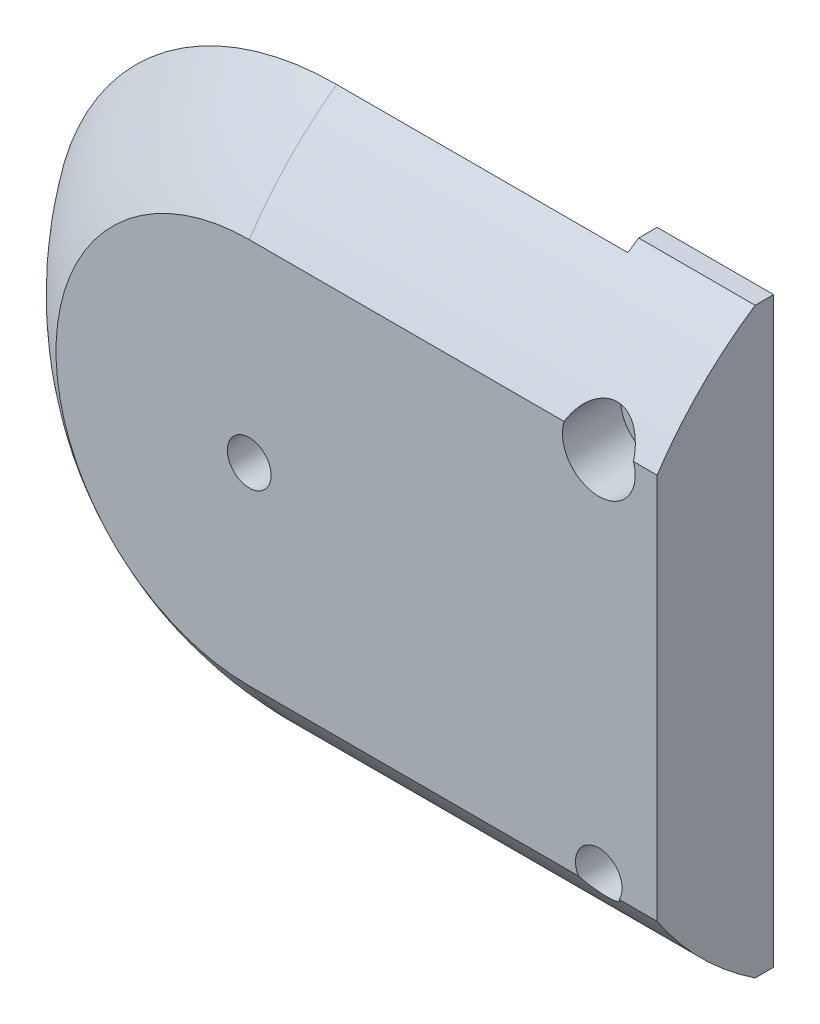
ISO-10303-21;
HEADER;
FILE_DESCRIPTION(('STEP AP214'),'2;1');
FILE_NAME('part.step','',(''),(''),'','','');
FILE_SCHEMA(('AUTOMOTIVE_DESIGN { 1 0 10303 214 1 1 1 1 }'));
ENDSEC;
DATA;
#1=APPLICATION_CONTEXT('core data for automotive mechanical design processes');
#2=APPLICATION_PROTOCOL_DEFINITION('international standard','automotive_design',2000,#1);
#3=PRODUCT_CONTEXT('',#1,'mechanical');
#4=PRODUCT('Part','Part','',(#3));
#5=PRODUCT_RELATED_PRODUCT_CATEGORY('part','',(#4));
#6=PRODUCT_DEFINITION_FORMATION('','',#4);
#7=PRODUCT_DEFINITION_CONTEXT('part definition',#1,'design');
#8=PRODUCT_DEFINITION('design','',#6,#7);
#9=PRODUCT_DEFINITION_SHAPE('','',#8);
#10=(LENGTH_UNIT() NAMED_UNIT(*) SI_UNIT(.MILLI.,.METRE.));
#11=(NAMED_UNIT(*) PLANE_ANGLE_UNIT() SI_UNIT($,.RADIAN.));
#12=(NAMED_UNIT(*) SI_UNIT($,.STERADIAN.) SOLID_ANGLE_UNIT());
#13=UNCERTAINTY_MEASURE_WITH_UNIT(LENGTH_MEASURE(1.E-05),#10,'distance_accuracy_value','');
#14=(GEOMETRIC_REPRESENTATION_CONTEXT(3) GLOBAL_UNCERTAINTY_ASSIGNED_CONTEXT((#13)) GLOBAL_UNIT_ASSIGNED_CONTEXT((#10,
#11,#12)) REPRESENTATION_CONTEXT('',''));
#15=CARTESIAN_POINT('',(0.,0.,0.));
#16=DIRECTION('',(0.,0.,1.));
#17=DIRECTION('',(1.,0.,0.));
#18=AXIS2_PLACEMENT_3D('',#15,#16,#17);
#19=CARTESIAN_POINT('',(0.,0.,0.));
#20=DIRECTION('',(0.,0.,1.));
#21=DIRECTION('',(1.,0.,0.));
#22=AXIS2_PLACEMENT_3D('',#19,#20,#21);
#23=PLANE('',#22);
#24=DIRECTION('',(-1.,0.,0.));
#25=VECTOR('',#24,1.);
#26=CARTESIAN_POINT('',(14.0000000040447,-6.6332495807108,0.));
#27=LINE('',#26,#25);
#28=CARTESIAN_POINT('',(14.0000000040447,-6.6332495807108,0.));
#29=VERTEX_POINT('',#28);
#30=CARTESIAN_POINT('',(12.7022248675215,-6.6332495807108,0.));
#31=VERTEX_POINT('',#30);
#32=EDGE_CURVE('E313',#29,#31,#27,.T.);
#33=ORIENTED_EDGE('',*,*,#32,.F.);
#34=DIRECTION('',(0.,-1.,0.));
#35=VECTOR('',#34,1.);
#36=CARTESIAN_POINT('',(14.0000000040447,0.,0.));
#37=LINE('',#36,#35);
#38=CARTESIAN_POINT('',(14.0000000040447,6.6332495807108,0.));
#39=VERTEX_POINT('',#38);
#40=EDGE_CURVE('E196',#39,#29,#37,.T.);
#41=ORIENTED_EDGE('',*,*,#40,.F.);
#42=DIRECTION('',(-1.,0.,0.));
#43=VECTOR('',#42,1.);
#44=CARTESIAN_POINT('',(14.0000000040447,6.6332495807108,0.));
#45=LINE('',#44,#43);
#46=CARTESIAN_POINT('',(13.1897982049532,6.6332495807108,0.));
#47=VERTEX_POINT('',#46);
#48=EDGE_CURVE('E292',#47,#39,#45,.F.);
#49=ORIENTED_EDGE('',*,*,#48,.F.);
#50=CARTESIAN_POINT('',(12.0000000040447,6.25,0.));
#51=DIRECTION('',(0.,0.,1.));
#52=DIRECTION('',(1.,0.,0.));
#53=AXIS2_PLACEMENT_3D('',#50,#51,#52);
#54=CIRCLE('',#53,1.25);
#55=CARTESIAN_POINT('',(10.8102018031363,6.6332495807108,0.));
#56=VERTEX_POINT('',#55);
#57=EDGE_CURVE('E165',#56,#47,#54,.T.);
#58=ORIENTED_EDGE('',*,*,#57,.F.);
#59=CARTESIAN_POINT('',(0.,6.6332495807108,0.));
#60=VERTEX_POINT('',#59);
#61=EDGE_CURVE('E309',#60,#56,#45,.F.);
#62=ORIENTED_EDGE('',*,*,#61,.F.);
#63=CARTESIAN_POINT('',(0.,0.,0.));
#64=DIRECTION('',(0.,0.,1.));
#65=DIRECTION('',(1.,0.,0.));
#66=AXIS2_PLACEMENT_3D('',#63,#64,#65);
#67=CIRCLE('',#66,6.6332495807108);
#68=CARTESIAN_POINT('',(0.,-6.6332495807108,0.));
#69=VERTEX_POINT('',#68);
#70=EDGE_CURVE('E141',#60,#69,#67,.T.);
#71=ORIENTED_EDGE('',*,*,#70,.T.);
#72=CARTESIAN_POINT('',(11.2977751405679,-6.6332495807108,0.));
#73=VERTEX_POINT('',#72);
#74=EDGE_CURVE('E137',#73,#69,#27,.T.);
#75=ORIENTED_EDGE('',*,*,#74,.F.);
#76=CARTESIAN_POINT('',(12.0000000040447,-6.25,0.));
#77=DIRECTION('',(0.,0.,1.));
#78=DIRECTION('',(1.,0.,0.));
#79=AXIS2_PLACEMENT_3D('',#76,#77,#78);
#80=CIRCLE('',#79,0.799999999999999);
#81=EDGE_CURVE('E172',#31,#73,#80,.T.);
#82=ORIENTED_EDGE('',*,*,#81,.F.);
#83=EDGE_LOOP('',(#33,#41,#49,#58,#62,#71,#75,#82));
#84=FACE_BOUND('',#83,.T.);
#85=CARTESIAN_POINT('',(4.04471248161009E-09,0.,0.));
#86=DIRECTION('',(0.,0.,1.));
#87=DIRECTION('',(1.,0.,0.));
#88=AXIS2_PLACEMENT_3D('',#85,#86,#87);
#89=CIRCLE('',#88,0.75);
#90=CARTESIAN_POINT('',(0.750000004044712,0.,0.));
#91=VERTEX_POINT('',#90);
#92=EDGE_CURVE('E181',#91,#91,#89,.T.);
#93=ORIENTED_EDGE('',*,*,#92,.F.);
#94=EDGE_LOOP('',(#93));
#95=FACE_BOUND('',#94,.T.);
#96=ADVANCED_FACE('F54',(#84,#95),#23,.T.);
#97=CARTESIAN_POINT('',(0.,0.,-3.));
#98=DIRECTION('',(0.,0.,1.));
#99=DIRECTION('',(1.,0.,0.));
#100=AXIS2_PLACEMENT_3D('',#97,#98,#99);
#101=PLANE('',#100);
#102=CARTESIAN_POINT('',(4.04471248161009E-09,0.,-3.));
#103=DIRECTION('',(0.,0.,1.));
#104=DIRECTION('',(1.,0.,0.));
#105=AXIS2_PLACEMENT_3D('',#102,#103,#104);
#106=CIRCLE('',#105,2.);
#107=CARTESIAN_POINT('',(2.00000000404471,0.,-3.));
#108=VERTEX_POINT('',#107);
#109=EDGE_CURVE('E185',#108,#108,#106,.T.);
#110=ORIENTED_EDGE('',*,*,#109,.T.);
#111=EDGE_LOOP('',(#110));
#112=FACE_BOUND('',#111,.T.);
#113=DIRECTION('',(0.,-1.,0.));
#114=VECTOR('',#113,1.);
#115=CARTESIAN_POINT('',(10.0000000040447,0.,-3.));
#116=LINE('',#115,#114);
#117=CARTESIAN_POINT('',(10.0000000040447,9.74679434480896,-3.));
#118=VERTEX_POINT('',#117);
#119=CARTESIAN_POINT('',(10.0000000040447,-9.74679434480896,-3.));
#120=VERTEX_POINT('',#119);
#121=EDGE_CURVE('E150',#118,#120,#116,.T.);
#122=ORIENTED_EDGE('',*,*,#121,.T.);
#123=DIRECTION('',(-1.,0.,0.));
#124=VECTOR('',#123,1.);
#125=CARTESIAN_POINT('',(14.0000000040447,-9.74679434480896,-3.));
#126=LINE('',#125,#124);
#127=CARTESIAN_POINT('',(0.,-9.74679434480896,-3.));
#128=VERTEX_POINT('',#127);
#129=EDGE_CURVE('E134',#120,#128,#126,.T.);
#130=ORIENTED_EDGE('',*,*,#129,.T.);
#131=CARTESIAN_POINT('',(0.,0.,-3.));
#132=DIRECTION('',(0.,0.,1.));
#133=DIRECTION('',(1.,0.,0.));
#134=AXIS2_PLACEMENT_3D('',#131,#132,#133);
#135=CIRCLE('',#134,9.74679434480896);
#136=CARTESIAN_POINT('',(0.,9.74679434480896,-3.));
#137=VERTEX_POINT('',#136);
#138=EDGE_CURVE('E12',#137,#128,#135,.T.);
#139=ORIENTED_EDGE('',*,*,#138,.F.);
#140=DIRECTION('',(-1.,0.,0.));
#141=VECTOR('',#140,1.);
#142=CARTESIAN_POINT('',(14.0000000040447,9.74679434480896,-3.));
#143=LINE('',#142,#141);
#144=EDGE_CURVE('E158',#137,#118,#143,.F.);
#145=ORIENTED_EDGE('',*,*,#144,.T.);
#146=EDGE_LOOP('',(#122,#130,#139,#145));
#147=FACE_BOUND('',#146,.T.);
#148=ADVANCED_FACE('F147',(#112,#147),#101,.F.);
#149=CARTESIAN_POINT('',(12.0000000040447,6.25,-5.));
#150=DIRECTION('',(0.,0.,1.));
#151=DIRECTION('',(1.,0.,0.));
#152=AXIS2_PLACEMENT_3D('',#149,#150,#151);
#153=CYLINDRICAL_SURFACE('',#152,0.800000000000002);
#154=CARTESIAN_POINT('',(12.0000000040447,6.25,-4.));
#155=DIRECTION('',(0.,0.,1.));
#156=DIRECTION('',(1.,0.,0.));
#157=AXIS2_PLACEMENT_3D('',#154,#155,#156);
#158=CIRCLE('',#157,0.800000000000002);
#159=CARTESIAN_POINT('',(12.8000000040447,6.25,-4.));
#160=VERTEX_POINT('',#159);
#161=EDGE_CURVE('E178',#160,#160,#158,.T.);
#162=ORIENTED_EDGE('',*,*,#161,.F.);
#163=EDGE_LOOP('',(#162));
#164=FACE_BOUND('',#163,.T.);
#165=CARTESIAN_POINT('',(12.0000000040447,6.25,-2.));
#166=DIRECTION('',(0.,0.,1.));
#167=DIRECTION('',(1.,0.,0.));
#168=AXIS2_PLACEMENT_3D('',#165,#166,#167);
#169=CIRCLE('',#168,0.800000000000002);
#170=CARTESIAN_POINT('',(12.8000000040447,6.25,-2.));
#171=VERTEX_POINT('',#170);
#172=EDGE_CURVE('E169',#171,#171,#169,.F.);
#173=ORIENTED_EDGE('',*,*,#172,.F.);
#174=EDGE_LOOP('',(#173));
#175=FACE_BOUND('',#174,.T.);
#176=ADVANCED_FACE('F218',(#164,#175),#153,.F.);
#177=CARTESIAN_POINT('',(0.,10.,-4.));
#178=DIRECTION('',(0.,-1.,0.));
#179=DIRECTION('',(0.,0.,-1.));
#180=AXIS2_PLACEMENT_3D('',#177,#178,#179);
#181=PLANE('',#180);
#182=DIRECTION('',(0.,0.,1.));
#183=VECTOR('',#182,1.);
#184=CARTESIAN_POINT('',(10.0000000040447,10.,-5.));
#185=LINE('',#184,#183);
#186=CARTESIAN_POINT('',(10.0000000040447,10.,-4.));
#187=VERTEX_POINT('',#186);
#188=CARTESIAN_POINT('',(10.0000000040447,10.,-3.3667504192892));
#189=VERTEX_POINT('',#188);
#190=EDGE_CURVE('E69',#187,#189,#185,.T.);
#191=ORIENTED_EDGE('',*,*,#190,.T.);
#192=DIRECTION('',(-1.,0.,0.));
#193=VECTOR('',#192,1.);
#194=CARTESIAN_POINT('',(14.0000000040447,10.,-3.3667504192892));
#195=LINE('',#194,#193);
#196=CARTESIAN_POINT('',(14.0000000040447,10.,-3.3667504192892));
#197=VERTEX_POINT('',#196);
#198=EDGE_CURVE('E160',#189,#197,#195,.F.);
#199=ORIENTED_EDGE('',*,*,#198,.T.);
#200=DIRECTION('',(0.,0.,1.));
#201=VECTOR('',#200,1.);
#202=CARTESIAN_POINT('',(14.0000000040447,10.,-4.));
#203=LINE('',#202,#201);
#204=CARTESIAN_POINT('',(14.0000000040447,10.,-4.));
#205=VERTEX_POINT('',#204);
#206=EDGE_CURVE('E208',#205,#197,#203,.T.);
#207=ORIENTED_EDGE('',*,*,#206,.F.);
#208=DIRECTION('',(1.,0.,0.));
#209=VECTOR('',#208,1.);
#210=CARTESIAN_POINT('',(0.,10.,-4.));
#211=LINE('',#210,#209);
#212=EDGE_CURVE('E76',#187,#205,#211,.T.);
#213=ORIENTED_EDGE('',*,*,#212,.F.);
#214=EDGE_LOOP('',(#191,#199,#207,#213));
#215=FACE_BOUND('',#214,.T.);
#216=ADVANCED_FACE('F56',(#215),#181,.F.);
#217=CARTESIAN_POINT('',(0.,-10.,-4.));
#218=DIRECTION('',(0.,1.,0.));
#219=DIRECTION('',(0.,0.,1.));
#220=AXIS2_PLACEMENT_3D('',#217,#218,#219);
#221=PLANE('',#220);
#222=DIRECTION('',(0.,0.,1.));
#223=VECTOR('',#222,1.);
#224=CARTESIAN_POINT('',(14.0000000040447,-10.,-4.));
#225=LINE('',#224,#223);
#226=CARTESIAN_POINT('',(14.0000000040447,-10.,-4.));
#227=VERTEX_POINT('',#226);
#228=CARTESIAN_POINT('',(14.0000000040447,-10.,-3.3667504192892));
#229=VERTEX_POINT('',#228);
#230=EDGE_CURVE('E205',#227,#229,#225,.T.);
#231=ORIENTED_EDGE('',*,*,#230,.T.);
#232=DIRECTION('',(-1.,0.,0.));
#233=VECTOR('',#232,1.);
#234=CARTESIAN_POINT('',(14.0000000040447,-10.,-3.3667504192892));
#235=LINE('',#234,#233);
#236=CARTESIAN_POINT('',(10.0000000040447,-10.,-3.3667504192892));
#237=VERTEX_POINT('',#236);
#238=EDGE_CURVE('E152',#229,#237,#235,.T.);
#239=ORIENTED_EDGE('',*,*,#238,.T.);
#240=DIRECTION('',(0.,0.,1.));
#241=VECTOR('',#240,1.);
#242=CARTESIAN_POINT('',(10.0000000040447,-10.,-5.));
#243=LINE('',#242,#241);
#244=CARTESIAN_POINT('',(10.0000000040447,-10.,-4.));
#245=VERTEX_POINT('',#244);
#246=EDGE_CURVE('E194',#245,#237,#243,.T.);
#247=ORIENTED_EDGE('',*,*,#246,.F.);
#248=DIRECTION('',(-1.,0.,0.));
#249=VECTOR('',#248,1.);
#250=CARTESIAN_POINT('',(0.,-10.,-4.));
#251=LINE('',#250,#249);
#252=EDGE_CURVE('E200',#227,#245,#251,.T.);
#253=ORIENTED_EDGE('',*,*,#252,.F.);
#254=EDGE_LOOP('',(#231,#239,#247,#253));
#255=FACE_BOUND('',#254,.T.);
#256=ADVANCED_FACE('F226',(#255),#221,.F.);
#257=CARTESIAN_POINT('',(0.,0.,-4.));
#258=DIRECTION('',(0.,0.,1.));
#259=DIRECTION('',(1.,0.,0.));
#260=AXIS2_PLACEMENT_3D('',#257,#258,#259);
#261=PLANE('',#260);
#262=CARTESIAN_POINT('',(12.0000000040447,-6.25,-4.));
#263=DIRECTION('',(0.,0.,1.));
#264=DIRECTION('',(1.,0.,0.));
#265=AXIS2_PLACEMENT_3D('',#262,#263,#264);
#266=CIRCLE('',#265,0.799999999999999);
#267=CARTESIAN_POINT('',(12.8000000040447,-6.25,-4.));
#268=VERTEX_POINT('',#267);
#269=EDGE_CURVE('E175',#268,#268,#266,.T.);
#270=ORIENTED_EDGE('',*,*,#269,.T.);
#271=EDGE_LOOP('',(#270));
#272=FACE_BOUND('',#271,.T.);
#273=ORIENTED_EDGE('',*,*,#161,.T.);
#274=EDGE_LOOP('',(#273));
#275=FACE_BOUND('',#274,.T.);
#276=DIRECTION('',(0.,-1.,0.));
#277=VECTOR('',#276,1.);
#278=CARTESIAN_POINT('',(10.0000000040447,0.,-4.));
#279=LINE('',#278,#277);
#280=EDGE_CURVE('E62',#187,#245,#279,.T.);
#281=ORIENTED_EDGE('',*,*,#280,.F.);
#282=ORIENTED_EDGE('',*,*,#212,.T.);
#283=DIRECTION('',(0.,-1.,0.));
#284=VECTOR('',#283,1.);
#285=CARTESIAN_POINT('',(14.0000000040447,0.,-4.));
#286=LINE('',#285,#284);
#287=EDGE_CURVE('E203',#205,#227,#286,.T.);
#288=ORIENTED_EDGE('',*,*,#287,.T.);
#289=ORIENTED_EDGE('',*,*,#252,.T.);
#290=EDGE_LOOP('',(#281,#282,#288,#289));
#291=FACE_BOUND('',#290,.T.);
#292=ADVANCED_FACE('F242',(#272,#275,#291),#261,.F.);
#293=CARTESIAN_POINT('',(14.0000000040447,0.,-4.));
#294=DIRECTION('',(-1.,0.,0.));
#295=DIRECTION('',(0.,0.,1.));
#296=AXIS2_PLACEMENT_3D('',#293,#294,#295);
#297=PLANE('',#296);
#298=ORIENTED_EDGE('',*,*,#40,.T.);
#299=CARTESIAN_POINT('',(14.0000000040447,0.,-10.));
#300=DIRECTION('',(1.,0.,0.));
#301=DIRECTION('',(0.,0.,-1.));
#302=AXIS2_PLACEMENT_3D('',#299,#300,#301);
#303=CIRCLE('',#302,12.);
#304=EDGE_CURVE('E260',#29,#229,#303,.T.);
#305=ORIENTED_EDGE('',*,*,#304,.T.);
#306=ORIENTED_EDGE('',*,*,#230,.F.);
#307=ORIENTED_EDGE('',*,*,#287,.F.);
#308=ORIENTED_EDGE('',*,*,#206,.T.);
#309=CARTESIAN_POINT('',(14.0000000040447,0.,-10.));
#310=DIRECTION('',(1.,0.,0.));
#311=DIRECTION('',(0.,0.,-1.));
#312=AXIS2_PLACEMENT_3D('',#309,#310,#311);
#313=CIRCLE('',#312,12.);
#314=EDGE_CURVE('E151',#197,#39,#313,.T.);
#315=ORIENTED_EDGE('',*,*,#314,.T.);
#316=EDGE_LOOP('',(#298,#305,#306,#307,#308,#315));
#317=FACE_BOUND('',#316,.T.);
#318=ADVANCED_FACE('F244',(#317),#297,.F.);
#319=CARTESIAN_POINT('',(10.0000000040447,0.,-5.));
#320=DIRECTION('',(-1.,0.,0.));
#321=DIRECTION('',(0.,-1.,0.));
#322=AXIS2_PLACEMENT_3D('',#319,#320,#321);
#323=PLANE('',#322);
#324=CARTESIAN_POINT('',(10.0000000040447,0.,-10.));
#325=DIRECTION('',(-1.,0.,0.));
#326=DIRECTION('',(0.,-1.,0.));
#327=AXIS2_PLACEMENT_3D('',#324,#325,#326);
#328=CIRCLE('',#327,12.);
#329=EDGE_CURVE('E312',#120,#237,#328,.F.);
#330=ORIENTED_EDGE('',*,*,#329,.F.);
#331=ORIENTED_EDGE('',*,*,#121,.F.);
#332=CARTESIAN_POINT('',(10.0000000040447,0.,-10.));
#333=DIRECTION('',(-1.,0.,0.));
#334=DIRECTION('',(0.,-1.,0.));
#335=AXIS2_PLACEMENT_3D('',#332,#333,#334);
#336=CIRCLE('',#335,12.);
#337=EDGE_CURVE('E310',#189,#118,#336,.F.);
#338=ORIENTED_EDGE('',*,*,#337,.F.);
#339=ORIENTED_EDGE('',*,*,#190,.F.);
#340=ORIENTED_EDGE('',*,*,#280,.T.);
#341=ORIENTED_EDGE('',*,*,#246,.T.);
#342=EDGE_LOOP('',(#330,#331,#338,#339,#340,#341));
#343=FACE_BOUND('',#342,.T.);
#344=ADVANCED_FACE('F246',(#343),#323,.T.);
#345=CARTESIAN_POINT('',(4.04471248161009E-09,0.,-5.));
#346=DIRECTION('',(0.,0.,1.));
#347=DIRECTION('',(1.,0.,0.));
#348=AXIS2_PLACEMENT_3D('',#345,#346,#347);
#349=CYLINDRICAL_SURFACE('',#348,2.);
#350=CARTESIAN_POINT('',(4.04471248161009E-09,0.,-5.));
#351=DIRECTION('',(0.,0.,1.));
#352=DIRECTION('',(1.,0.,0.));
#353=AXIS2_PLACEMENT_3D('',#350,#351,#352);
#354=CIRCLE('',#353,2.);
#355=CARTESIAN_POINT('',(2.00000000404471,0.,-5.));
#356=VERTEX_POINT('',#355);
#357=EDGE_CURVE('E188',#356,#356,#354,.T.);
#358=ORIENTED_EDGE('',*,*,#357,.T.);
#359=EDGE_LOOP('',(#358));
#360=FACE_BOUND('',#359,.T.);
#361=ORIENTED_EDGE('',*,*,#109,.F.);
#362=EDGE_LOOP('',(#361));
#363=FACE_BOUND('',#362,.T.);
#364=ADVANCED_FACE('F320',(#360,#363),#349,.T.);
#365=CARTESIAN_POINT('',(4.04471248161009E-09,0.,-5.));
#366=DIRECTION('',(0.,0.,1.));
#367=DIRECTION('',(1.,0.,0.));
#368=AXIS2_PLACEMENT_3D('',#365,#366,#367);
#369=PLANE('',#368);
#370=CARTESIAN_POINT('',(4.04471248161009E-09,0.,-5.));
#371=DIRECTION('',(0.,0.,1.));
#372=DIRECTION('',(1.,0.,0.));
#373=AXIS2_PLACEMENT_3D('',#370,#371,#372);
#374=CIRCLE('',#373,0.75);
#375=CARTESIAN_POINT('',(0.750000004044712,0.,-5.));
#376=VERTEX_POINT('',#375);
#377=EDGE_CURVE('E182',#376,#376,#374,.T.);
#378=ORIENTED_EDGE('',*,*,#377,.T.);
#379=EDGE_LOOP('',(#378));
#380=FACE_BOUND('',#379,.T.);
#381=ORIENTED_EDGE('',*,*,#357,.F.);
#382=EDGE_LOOP('',(#381));
#383=FACE_BOUND('',#382,.T.);
#384=ADVANCED_FACE('F324',(#380,#383),#369,.F.);
#385=CARTESIAN_POINT('',(4.04471248161009E-09,0.,-5.));
#386=DIRECTION('',(0.,0.,1.));
#387=DIRECTION('',(1.,0.,0.));
#388=AXIS2_PLACEMENT_3D('',#385,#386,#387);
#389=CYLINDRICAL_SURFACE('',#388,0.75);
#390=ORIENTED_EDGE('',*,*,#377,.F.);
#391=EDGE_LOOP('',(#390));
#392=FACE_BOUND('',#391,.T.);
#393=ORIENTED_EDGE('',*,*,#92,.T.);
#394=EDGE_LOOP('',(#393));
#395=FACE_BOUND('',#394,.T.);
#396=ADVANCED_FACE('F303',(#392,#395),#389,.F.);
#397=CARTESIAN_POINT('',(12.0000000040447,-6.25,-5.));
#398=DIRECTION('',(0.,0.,1.));
#399=DIRECTION('',(1.,0.,0.));
#400=AXIS2_PLACEMENT_3D('',#397,#398,#399);
#401=CYLINDRICAL_SURFACE('',#400,0.799999999999999);
#402=ORIENTED_EDGE('',*,*,#81,.T.);
#403=CARTESIAN_POINT('',(11.2977751405679,-6.6332495807108,0.));
#404=CARTESIAN_POINT('',(11.3196969751772,-6.67343057533731,-0.0266404093304857));
#405=CARTESIAN_POINT('',(11.3453260707405,-6.71216672349842,-0.0526965732116884));
#406=CARTESIAN_POINT('',(11.4039375340328,-6.78566017921512,-0.102690349356819));
#407=CARTESIAN_POINT('',(11.4369640472608,-6.82039162001087,-0.126613984358145));
#408=CARTESIAN_POINT('',(11.504017444546,-6.87900161122777,-0.167380343010836));
#409=CARTESIAN_POINT('',(11.5369837924921,-6.90372550970297,-0.18474034515973));
#410=CARTESIAN_POINT('',(11.6073942386669,-6.94827709698219,-0.216228459272557));
#411=CARTESIAN_POINT('',(11.6448287791107,-6.96811496826996,-0.230363287894445));
#412=CARTESIAN_POINT('',(11.7238642766907,-7.00207265238322,-0.254671737605358));
#413=CARTESIAN_POINT('',(11.7654988451796,-7.01614087658448,-0.264809590412562));
#414=CARTESIAN_POINT('',(11.8513894314681,-7.03731508039174,-0.280104294329564));
#415=CARTESIAN_POINT('',(11.8956435684367,-7.04442599251023,-0.285264674272181));
#416=CARTESIAN_POINT('',(11.9787105766612,-7.05064505812971,-0.289777842124935));
#417=CARTESIAN_POINT('',(12.0174142421614,-7.05073732748972,-0.289844801700726));
#418=CARTESIAN_POINT('',(12.0942203195168,-7.04536346100232,-0.285944980805876));
#419=CARTESIAN_POINT('',(12.1323228552228,-7.0398984857131,-0.281979042553436));
#420=CARTESIAN_POINT('',(12.2049792977764,-7.02414449567698,-0.270586794572166));
#421=CARTESIAN_POINT('',(12.2396156986387,-7.01410184836698,-0.263337316083468));
#422=CARTESIAN_POINT('',(12.3065554647895,-6.98979212031997,-0.245871173139462));
#423=CARTESIAN_POINT('',(12.3388589822282,-6.97552531539184,-0.235654702409484));
#424=CARTESIAN_POINT('',(12.4034054175335,-6.94188552163604,-0.21170664273038));
#425=CARTESIAN_POINT('',(12.4353809076276,-6.9221684012373,-0.197741356652356));
#426=CARTESIAN_POINT('',(12.4955999270791,-6.87909049269908,-0.167461650457403));
#427=CARTESIAN_POINT('',(12.5238367570788,-6.85572332297777,-0.15114311994622));
#428=CARTESIAN_POINT('',(12.5811818282674,-6.80141925602571,-0.113546291997457));
#429=CARTESIAN_POINT('',(12.6094828175999,-6.7698819327225,-0.0919091716150705));
#430=CARTESIAN_POINT('',(12.6602236237908,-6.70369169379657,-0.0470029070884062));
#431=CARTESIAN_POINT('',(12.6826876811736,-6.6690524938415,-0.023741038754628));
#432=CARTESIAN_POINT('',(12.7022248675215,-6.6332495807108,0.));
#433=B_SPLINE_CURVE_WITH_KNOTS('',3,(#403,#404,#405,#406,#407,#408,#409,#410,#411,#412,#413,
#414,#415,#416,#417,#418,#419,#420,#421,#422,#423,#424,#425,#426,#427,#428,#429,#430,#431,#432),
.UNSPECIFIED.,.F.,.F.,(4,2,2,2,2,2,2,2,2,2,2,2,2,2,4),(0.,0.158964557858903,0.318904313775007,
0.452503407430773,0.585821678824549,0.720307293434344,0.854697492791085,0.970203643141499,
1.08568567648925,1.19557661272694,1.30546037541252,1.42523957238804,1.54523057952049,
1.68744568634953,1.82906038306879),.UNSPECIFIED.);
#434=EDGE_CURVE('E263',#73,#31,#433,.T.);
#435=ORIENTED_EDGE('',*,*,#434,.T.);
#436=EDGE_LOOP('',(#402,#435));
#437=FACE_BOUND('',#436,.T.);
#438=ORIENTED_EDGE('',*,*,#269,.F.);
#439=EDGE_LOOP('',(#438));
#440=FACE_BOUND('',#439,.T.);
#441=ADVANCED_FACE('F273',(#437,#440),#401,.F.);
#442=CARTESIAN_POINT('',(12.0000000040447,6.25,-2.));
#443=DIRECTION('',(0.,0.,1.));
#444=DIRECTION('',(1.,0.,0.));
#445=AXIS2_PLACEMENT_3D('',#442,#443,#444);
#446=PLANE('',#445);
#447=CARTESIAN_POINT('',(12.0000000040447,6.25,-2.));
#448=DIRECTION('',(0.,0.,1.));
#449=DIRECTION('',(1.,0.,0.));
#450=AXIS2_PLACEMENT_3D('',#447,#448,#449);
#451=CIRCLE('',#450,1.25);
#452=CARTESIAN_POINT('',(13.2500000040447,6.25,-2.));
#453=VERTEX_POINT('',#452);
#454=EDGE_CURVE('E166',#453,#453,#451,.T.);
#455=ORIENTED_EDGE('',*,*,#454,.T.);
#456=EDGE_LOOP('',(#455));
#457=FACE_BOUND('',#456,.T.);
#458=ORIENTED_EDGE('',*,*,#172,.T.);
#459=EDGE_LOOP('',(#458));
#460=FACE_BOUND('',#459,.T.);
#461=ADVANCED_FACE('F216',(#457,#460),#446,.T.);
#462=CARTESIAN_POINT('',(12.0000000040447,6.25,-2.));
#463=DIRECTION('',(0.,0.,1.));
#464=DIRECTION('',(1.,0.,0.));
#465=AXIS2_PLACEMENT_3D('',#462,#463,#464);
#466=CYLINDRICAL_SURFACE('',#465,1.25);
#467=ORIENTED_EDGE('',*,*,#454,.F.);
#468=EDGE_LOOP('',(#467));
#469=FACE_BOUND('',#468,.T.);
#470=ORIENTED_EDGE('',*,*,#57,.T.);
#471=CARTESIAN_POINT('',(13.1897982049532,6.6332495807108,0.));
#472=CARTESIAN_POINT('',(13.1760112045832,6.6760087882392,-0.0283616226910743));
#473=CARTESIAN_POINT('',(13.1599399388248,6.71803855463574,-0.0566384645604791));
#474=CARTESIAN_POINT('',(13.1232041898434,6.80041761045395,-0.112795660502669));
#475=CARTESIAN_POINT('',(13.1025330372643,6.84076435777378,-0.140675375690086));
#476=CARTESIAN_POINT('',(13.0333934124205,6.95920665563889,-0.223564192518991));
#477=CARTESIAN_POINT('',(12.9779546120899,7.0342133932454,-0.277495591106917));
#478=CARTESIAN_POINT('',(12.8687502627801,7.15116328539714,-0.363379355782013));
#479=CARTESIAN_POINT('',(12.81959588001,7.19622735422989,-0.397030437339819));
#480=CARTESIAN_POINT('',(12.7129402555907,7.27895192105796,-0.459584671059699));
#481=CARTESIAN_POINT('',(12.6554681592328,7.31663723187446,-0.488503680084833));
#482=CARTESIAN_POINT('',(12.5435597851907,7.3770991486764,-0.535349183717326));
#483=CARTESIAN_POINT('',(12.4903465105764,7.40133007544712,-0.554313423672289));
#484=CARTESIAN_POINT('',(12.3795195979486,7.44245595798418,-0.586682991778203));
#485=CARTESIAN_POINT('',(12.3219068700176,7.45935242616792,-0.600089465954227));
#486=CARTESIAN_POINT('',(12.2033717997772,7.48484118535614,-0.620371738033944));
#487=CARTESIAN_POINT('',(12.1424324215749,7.49338545603514,-0.627209767311376));
#488=CARTESIAN_POINT('',(12.0195882831422,7.50135887925031,-0.633589547601545));
#489=CARTESIAN_POINT('',(11.9576839824785,7.50079224607508,-0.633134671979768));
#490=CARTESIAN_POINT('',(11.8412178763414,7.49111366876401,-0.625393693748943));
#491=CARTESIAN_POINT('',(11.7865355738911,7.48285271039057,-0.618787898273294));
#492=CARTESIAN_POINT('',(11.6796173238883,7.45948372494784,-0.600195572862189));
#493=CARTESIAN_POINT('',(11.6273818687543,7.44437432613298,-0.588207964951952));
#494=CARTESIAN_POINT('',(11.5245229846124,7.40737798936943,-0.559061368124892));
#495=CARTESIAN_POINT('',(11.4740366000899,7.38525496064453,-0.541722902670714));
#496=CARTESIAN_POINT('',(11.3776245398573,7.33540211453244,-0.503007242275245));
#497=CARTESIAN_POINT('',(11.3316997844312,7.30767116919062,-0.481629234892976));
#498=CARTESIAN_POINT('',(11.2376033942841,7.2424954750831,-0.43191778102568));
#499=CARTESIAN_POINT('',(11.1903203372888,7.20420254541008,-0.403018782859666));
#500=CARTESIAN_POINT('',(11.1027273944862,7.12235540653427,-0.342118524194599));
#501=CARTESIAN_POINT('',(11.0624303653339,7.07879174229112,-0.310111709585624));
#502=CARTESIAN_POINT('',(10.9770265527518,6.97254226767751,-0.23326170388783));
#503=CARTESIAN_POINT('',(10.934624238002,6.90824802280791,-0.187631612656498));
#504=CARTESIAN_POINT('',(10.8627571396239,6.77432180420703,-0.0946788307261212));
#505=CARTESIAN_POINT('',(10.8332433880325,6.70471123523068,-0.0473632983759527));
#506=CARTESIAN_POINT('',(10.8102018031363,6.6332495807108,0.));
#507=B_SPLINE_CURVE_WITH_KNOTS('',3,(#471,#472,#473,#474,#475,#476,#477,#478,#479,#480,#481,
#482,#483,#484,#485,#486,#487,#488,#489,#490,#491,#492,#493,#494,#495,#496,#497,#498,#499,#500,
#501,#502,#503,#504,#505,#506),.UNSPECIFIED.,.F.,.F.,(4,2,2,2,2,2,2,2,2,2,2,2,2,2,2,2,2,4),(0.,
0.159251364799164,0.318735149581607,0.639506493065131,0.862799379609011,1.08532798461955,
1.2689898904694,1.45261390591918,1.63728755073478,1.82187577640286,1.98820157106733,
2.15456069559285,2.32725217451296,2.49997842253783,2.70132478454905,2.90303784668897,
3.17041381481335,3.43676490167394),.UNSPECIFIED.);
#508=EDGE_CURVE('E285',#47,#56,#507,.T.);
#509=ORIENTED_EDGE('',*,*,#508,.T.);
#510=EDGE_LOOP('',(#470,#509));
#511=FACE_BOUND('',#510,.T.);
#512=ADVANCED_FACE('F294',(#469,#511),#466,.F.);
#513=CARTESIAN_POINT('',(0.,0.,-10.));
#514=DIRECTION('',(0.,0.,-1.));
#515=DIRECTION('',(0.,-1.,0.));
#516=AXIS2_PLACEMENT_3D('',#513,#514,#515);
#517=SPHERICAL_SURFACE('',#516,12.);
#518=CARTESIAN_POINT('',(0.,0.,-10.));
#519=DIRECTION('',(1.,0.,0.));
#520=DIRECTION('',(0.,0.,-1.));
#521=AXIS2_PLACEMENT_3D('',#518,#519,#520);
#522=CIRCLE('',#521,12.);
#523=EDGE_CURVE('E142',#137,#60,#522,.T.);
#524=ORIENTED_EDGE('',*,*,#523,.F.);
#525=ORIENTED_EDGE('',*,*,#138,.T.);
#526=CARTESIAN_POINT('',(0.,0.,-10.));
#527=DIRECTION('',(-1.,0.,0.));
#528=DIRECTION('',(0.,0.,-1.));
#529=AXIS2_PLACEMENT_3D('',#526,#527,#528);
#530=CIRCLE('',#529,12.);
#531=EDGE_CURVE('E131',#128,#69,#530,.T.);
#532=ORIENTED_EDGE('',*,*,#531,.T.);
#533=ORIENTED_EDGE('',*,*,#70,.F.);
#534=EDGE_LOOP('',(#524,#525,#532,#533));
#535=FACE_BOUND('',#534,.T.);
#536=ADVANCED_FACE('F155',(#535),#517,.T.);
#537=CARTESIAN_POINT('',(14.0000000040447,0.,-10.));
#538=DIRECTION('',(-1.,0.,0.));
#539=DIRECTION('',(0.,0.,1.));
#540=AXIS2_PLACEMENT_3D('',#537,#538,#539);
#541=CYLINDRICAL_SURFACE('',#540,12.);
#542=ORIENTED_EDGE('',*,*,#523,.T.);
#543=ORIENTED_EDGE('',*,*,#61,.T.);
#544=ORIENTED_EDGE('',*,*,#508,.F.);
#545=ORIENTED_EDGE('',*,*,#48,.T.);
#546=ORIENTED_EDGE('',*,*,#314,.F.);
#547=ORIENTED_EDGE('',*,*,#198,.F.);
#548=ORIENTED_EDGE('',*,*,#337,.T.);
#549=ORIENTED_EDGE('',*,*,#144,.F.);
#550=EDGE_LOOP('',(#542,#543,#544,#545,#546,#547,#548,#549));
#551=FACE_BOUND('',#550,.T.);
#552=ADVANCED_FACE('F279',(#551),#541,.T.);
#553=CARTESIAN_POINT('',(14.0000000040447,0.,-10.));
#554=DIRECTION('',(-1.,0.,0.));
#555=DIRECTION('',(0.,0.,1.));
#556=AXIS2_PLACEMENT_3D('',#553,#554,#555);
#557=CYLINDRICAL_SURFACE('',#556,12.);
#558=ORIENTED_EDGE('',*,*,#329,.T.);
#559=ORIENTED_EDGE('',*,*,#238,.F.);
#560=ORIENTED_EDGE('',*,*,#304,.F.);
#561=ORIENTED_EDGE('',*,*,#32,.T.);
#562=ORIENTED_EDGE('',*,*,#434,.F.);
#563=ORIENTED_EDGE('',*,*,#74,.T.);
#564=ORIENTED_EDGE('',*,*,#531,.F.);
#565=ORIENTED_EDGE('',*,*,#129,.F.);
#566=EDGE_LOOP('',(#558,#559,#560,#561,#562,#563,#564,#565));
#567=FACE_BOUND('',#566,.T.);
#568=ADVANCED_FACE('F133',(#567),#557,.T.);
#569=CLOSED_SHELL('',(#96,#148,#176,#216,#256,#292,#318,#344,#364,#384,#396,#441,#461,#512,#536,
#552,#568));
#570=MANIFOLD_SOLID_BREP('B2',#569);
#571=ADVANCED_BREP_SHAPE_REPRESENTATION('',(#18,#570),#14);
#572=SHAPE_DEFINITION_REPRESENTATION(#9,#571);
ENDSEC;
END-ISO-10303-21;
